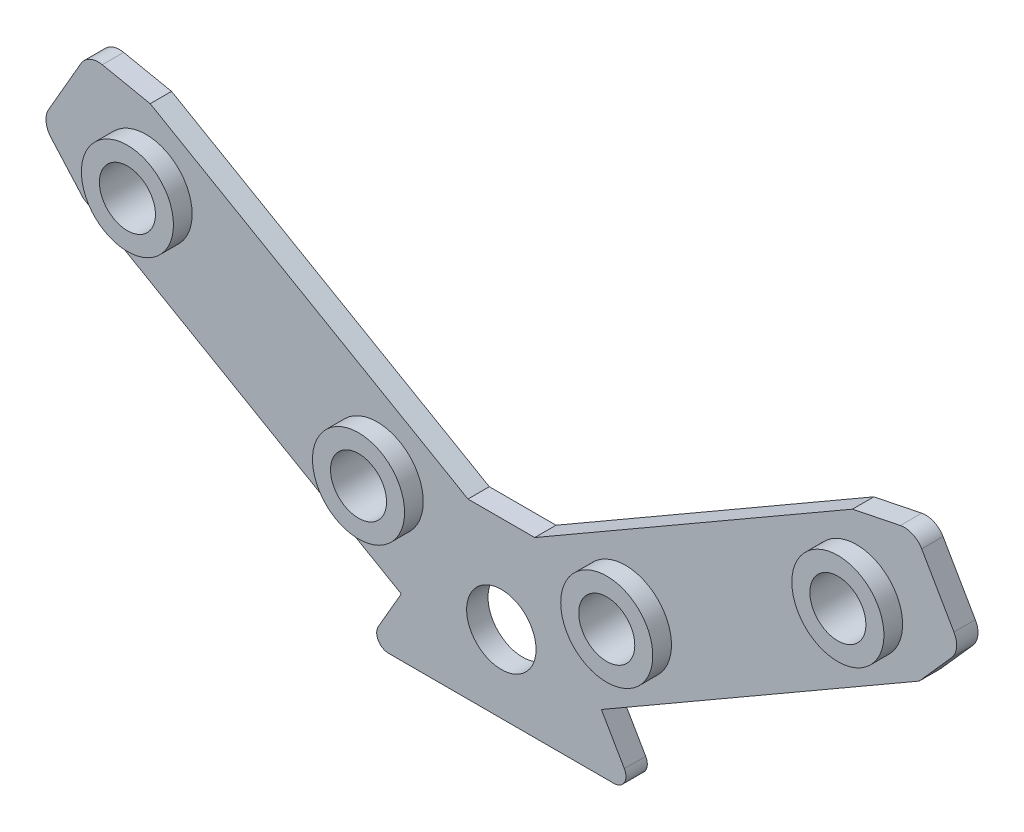
ISO-10303-21;
HEADER;
FILE_DESCRIPTION(('STEP AP214'),'2;1');
FILE_NAME('part.step','',(''),(''),'','','');
FILE_SCHEMA(('AUTOMOTIVE_DESIGN { 1 0 10303 214 1 1 1 1 }'));
ENDSEC;
DATA;
#1=APPLICATION_CONTEXT('core data for automotive mechanical design processes');
#2=APPLICATION_PROTOCOL_DEFINITION('international standard','automotive_design',2000,#1);
#3=PRODUCT_CONTEXT('',#1,'mechanical');
#4=PRODUCT('Part','Part','',(#3));
#5=PRODUCT_RELATED_PRODUCT_CATEGORY('part','',(#4));
#6=PRODUCT_DEFINITION_FORMATION('','',#4);
#7=PRODUCT_DEFINITION_CONTEXT('part definition',#1,'design');
#8=PRODUCT_DEFINITION('design','',#6,#7);
#9=PRODUCT_DEFINITION_SHAPE('','',#8);
#10=(LENGTH_UNIT() NAMED_UNIT(*) SI_UNIT(.MILLI.,.METRE.));
#11=(NAMED_UNIT(*) PLANE_ANGLE_UNIT() SI_UNIT($,.RADIAN.));
#12=(NAMED_UNIT(*) SI_UNIT($,.STERADIAN.) SOLID_ANGLE_UNIT());
#13=UNCERTAINTY_MEASURE_WITH_UNIT(LENGTH_MEASURE(1.E-05),#10,'distance_accuracy_value','');
#14=(GEOMETRIC_REPRESENTATION_CONTEXT(3) GLOBAL_UNCERTAINTY_ASSIGNED_CONTEXT((#13)) GLOBAL_UNIT_ASSIGNED_CONTEXT((#10,
#11,#12)) REPRESENTATION_CONTEXT('',''));
#15=CARTESIAN_POINT('',(0.,0.,0.));
#16=DIRECTION('',(0.,0.,1.));
#17=DIRECTION('',(1.,0.,0.));
#18=AXIS2_PLACEMENT_3D('',#15,#16,#17);
#19=CARTESIAN_POINT('',(-8.44115427318807,-4.87350269189619,1.6));
#20=DIRECTION('',(0.,0.,1.));
#21=DIRECTION('',(1.,0.,0.));
#22=AXIS2_PLACEMENT_3D('',#19,#20,#21);
#23=PLANE('',#22);
#24=CARTESIAN_POINT('',(-9.30111283664478,5.37000000000016,1.6));
#25=DIRECTION('',(0.,0.,1.));
#26=DIRECTION('',(1.,0.,0.));
#27=AXIS2_PLACEMENT_3D('',#24,#25,#26);
#28=CIRCLE('',#27,3.45);
#29=CARTESIAN_POINT('',(-5.85111283664478,5.37000000000016,1.6));
#30=VERTEX_POINT('',#29);
#31=EDGE_CURVE('E454',#30,#30,#28,.T.);
#32=ORIENTED_EDGE('',*,*,#31,.F.);
#33=EDGE_LOOP('',(#32));
#34=FACE_BOUND('',#33,.T.);
#35=CARTESIAN_POINT('',(26.6216209123336,15.3700000000002,1.6));
#36=DIRECTION('',(0.,0.,1.));
#37=DIRECTION('',(-1.,0.,0.));
#38=AXIS2_PLACEMENT_3D('',#35,#36,#37);
#39=CIRCLE('',#38,3.45);
#40=CARTESIAN_POINT('',(23.1716209123336,15.3700000000002,1.6));
#41=VERTEX_POINT('',#40);
#42=EDGE_CURVE('E466',#41,#41,#39,.T.);
#43=ORIENTED_EDGE('',*,*,#42,.F.);
#44=EDGE_LOOP('',(#43));
#45=FACE_BOUND('',#44,.T.);
#46=CARTESIAN_POINT('',(-8.44115427318807,-4.87350269189619,1.6));
#47=DIRECTION('',(0.,0.,1.));
#48=DIRECTION('',(1.,0.,0.));
#49=AXIS2_PLACEMENT_3D('',#46,#47,#48);
#50=CIRCLE('',#49,0.899999999999998);
#51=CARTESIAN_POINT('',(-9.22057713659406,-4.42350269189619,1.6));
#52=VERTEX_POINT('',#51);
#53=CARTESIAN_POINT('',(-8.44115427318807,-5.77350269189619,1.6));
#54=VERTEX_POINT('',#53);
#55=EDGE_CURVE('E243',#52,#54,#50,.T.);
#56=ORIENTED_EDGE('',*,*,#55,.T.);
#57=DIRECTION('',(1.,0.,0.));
#58=VECTOR('',#57,1.);
#59=CARTESIAN_POINT('',(8.44115427318807,-5.77350269189619,1.6));
#60=LINE('',#59,#58);
#61=CARTESIAN_POINT('',(8.44115427318807,-5.77350269189619,1.6));
#62=VERTEX_POINT('',#61);
#63=EDGE_CURVE('E131',#54,#62,#60,.T.);
#64=ORIENTED_EDGE('',*,*,#63,.T.);
#65=CARTESIAN_POINT('',(8.44115427318807,-4.87350269189619,1.6));
#66=DIRECTION('',(0.,0.,1.));
#67=DIRECTION('',(-1.,0.,0.));
#68=AXIS2_PLACEMENT_3D('',#65,#66,#67);
#69=CIRCLE('',#68,0.899999999999998);
#70=CARTESIAN_POINT('',(9.22057713659406,-4.42350269189619,1.6));
#71=VERTEX_POINT('',#70);
#72=EDGE_CURVE('E294',#62,#71,#69,.T.);
#73=ORIENTED_EDGE('',*,*,#72,.T.);
#74=DIRECTION('',(-0.500000000000004,0.866025403784436,0.));
#75=VECTOR('',#74,1.);
#76=CARTESIAN_POINT('',(7.50000000000004,-1.44337567297401,1.6));
#77=LINE('',#76,#75);
#78=CARTESIAN_POINT('',(7.50000000000004,-1.44337567297401,1.6));
#79=VERTEX_POINT('',#78);
#80=EDGE_CURVE('E313',#71,#79,#77,.T.);
#81=ORIENTED_EDGE('',*,*,#80,.T.);
#82=DIRECTION('',(0.866025403784436,0.500000000000004,0.));
#83=VECTOR('',#82,1.);
#84=CARTESIAN_POINT('',(7.50000000000004,-1.44337567297401,1.6));
#85=LINE('',#84,#83);
#86=CARTESIAN_POINT('',(31.315698604072,12.3066243270261,1.6));
#87=VERTEX_POINT('',#86);
#88=EDGE_CURVE('E310',#79,#87,#85,.T.);
#89=ORIENTED_EDGE('',*,*,#88,.T.);
#90=DIRECTION('',(0.663469953249325,0.748202927777844,0.));
#91=VECTOR('',#90,1.);
#92=CARTESIAN_POINT('',(31.315698604072,12.3066243270261,1.6));
#93=LINE('',#92,#91);
#94=CARTESIAN_POINT('',(33.74550979205,15.0467511946995,1.6));
#95=VERTEX_POINT('',#94);
#96=EDGE_CURVE('E312',#87,#95,#93,.T.);
#97=ORIENTED_EDGE('',*,*,#96,.T.);
#98=CARTESIAN_POINT('',(32.6232054003832,16.0419561245735,1.6));
#99=DIRECTION('',(0.,0.,1.));
#100=DIRECTION('',(1.,0.,0.));
#101=AXIS2_PLACEMENT_3D('',#98,#99,#100);
#102=CIRCLE('',#101,1.5);
#103=CARTESIAN_POINT('',(33.9222435060599,16.7919561245735,1.6));
#104=VERTEX_POINT('',#103);
#105=EDGE_CURVE('E315',#95,#104,#102,.T.);
#106=ORIENTED_EDGE('',*,*,#105,.T.);
#107=DIRECTION('',(-0.500000000000004,0.866025403784436,0.));
#108=VECTOR('',#107,1.);
#109=CARTESIAN_POINT('',(31.5033823361441,20.9815465673231,1.6));
#110=LINE('',#109,#108);
#111=CARTESIAN_POINT('',(31.5033823361441,20.9815465673231,1.6));
#112=VERTEX_POINT('',#111);
#113=EDGE_CURVE('E321',#104,#112,#110,.T.);
#114=ORIENTED_EDGE('',*,*,#113,.T.);
#115=CARTESIAN_POINT('',(30.2043442304674,20.2315465673231,1.6));
#116=DIRECTION('',(0.,0.,1.));
#117=DIRECTION('',(-1.,0.,0.));
#118=AXIS2_PLACEMENT_3D('',#115,#116,#117);
#119=CIRCLE('',#118,1.5);
#120=CARTESIAN_POINT('',(29.9036236750584,21.7010931462224,1.6));
#121=VERTEX_POINT('',#120);
#122=EDGE_CURVE('E323',#112,#121,#119,.T.);
#123=ORIENTED_EDGE('',*,*,#122,.T.);
#124=DIRECTION('',(-0.979697719266168,-0.200480370272677,0.));
#125=VECTOR('',#124,1.);
#126=CARTESIAN_POINT('',(26.315698604072,20.9668783648705,1.6));
#127=LINE('',#126,#125);
#128=CARTESIAN_POINT('',(26.315698604072,20.9668783648705,1.6));
#129=VERTEX_POINT('',#128);
#130=EDGE_CURVE('E325',#121,#129,#127,.T.);
#131=ORIENTED_EDGE('',*,*,#130,.T.);
#132=DIRECTION('',(-0.866025403784436,-0.500000000000005,0.));
#133=VECTOR('',#132,1.);
#134=CARTESIAN_POINT('',(2.5,7.21687836487035,1.6));
#135=LINE('',#134,#133);
#136=CARTESIAN_POINT('',(2.5,7.21687836487035,1.6));
#137=VERTEX_POINT('',#136);
#138=EDGE_CURVE('E327',#129,#137,#135,.T.);
#139=ORIENTED_EDGE('',*,*,#138,.T.);
#140=DIRECTION('',(-1.,0.,0.));
#141=VECTOR('',#140,1.);
#142=CARTESIAN_POINT('',(-2.5,7.21687836487035,1.6));
#143=LINE('',#142,#141);
#144=CARTESIAN_POINT('',(-2.5,7.21687836487035,1.6));
#145=VERTEX_POINT('',#144);
#146=EDGE_CURVE('E329',#137,#145,#143,.T.);
#147=ORIENTED_EDGE('',*,*,#146,.T.);
#148=DIRECTION('',(-0.866025403784436,0.500000000000005,0.));
#149=VECTOR('',#148,1.);
#150=CARTESIAN_POINT('',(-2.5,7.21687836487035,1.6));
#151=LINE('',#150,#149);
#152=CARTESIAN_POINT('',(-26.315698604072,20.9668783648705,1.6));
#153=VERTEX_POINT('',#152);
#154=EDGE_CURVE('E331',#145,#153,#151,.T.);
#155=ORIENTED_EDGE('',*,*,#154,.T.);
#156=DIRECTION('',(-0.979697719266168,0.200480370272677,0.));
#157=VECTOR('',#156,1.);
#158=CARTESIAN_POINT('',(-26.315698604072,20.9668783648705,1.6));
#159=LINE('',#158,#157);
#160=CARTESIAN_POINT('',(-29.9036236750584,21.7010931462224,1.6));
#161=VERTEX_POINT('',#160);
#162=EDGE_CURVE('E333',#153,#161,#159,.T.);
#163=ORIENTED_EDGE('',*,*,#162,.T.);
#164=CARTESIAN_POINT('',(-30.2043442304674,20.2315465673231,1.6));
#165=DIRECTION('',(0.,0.,1.));
#166=DIRECTION('',(-1.,0.,0.));
#167=AXIS2_PLACEMENT_3D('',#164,#165,#166);
#168=CIRCLE('',#167,1.5);
#169=CARTESIAN_POINT('',(-31.5033823361441,20.9815465673231,1.6));
#170=VERTEX_POINT('',#169);
#171=EDGE_CURVE('E335',#161,#170,#168,.T.);
#172=ORIENTED_EDGE('',*,*,#171,.T.);
#173=DIRECTION('',(-0.500000000000004,-0.866025403784436,0.));
#174=VECTOR('',#173,1.);
#175=CARTESIAN_POINT('',(-31.5033823361441,20.9815465673231,1.6));
#176=LINE('',#175,#174);
#177=CARTESIAN_POINT('',(-33.9222435060599,16.7919561245735,1.6));
#178=VERTEX_POINT('',#177);
#179=EDGE_CURVE('E337',#170,#178,#176,.T.);
#180=ORIENTED_EDGE('',*,*,#179,.T.);
#181=CARTESIAN_POINT('',(-32.6232054003832,16.0419561245735,1.6));
#182=DIRECTION('',(0.,0.,1.));
#183=DIRECTION('',(-1.,0.,0.));
#184=AXIS2_PLACEMENT_3D('',#181,#182,#183);
#185=CIRCLE('',#184,1.5);
#186=CARTESIAN_POINT('',(-33.74550979205,15.0467511946995,1.6));
#187=VERTEX_POINT('',#186);
#188=EDGE_CURVE('E186',#178,#187,#185,.T.);
#189=ORIENTED_EDGE('',*,*,#188,.T.);
#190=DIRECTION('',(0.663469953249326,-0.748202927777844,0.));
#191=VECTOR('',#190,1.);
#192=CARTESIAN_POINT('',(-31.315698604072,12.3066243270261,1.6));
#193=LINE('',#192,#191);
#194=CARTESIAN_POINT('',(-31.315698604072,12.3066243270261,1.6));
#195=VERTEX_POINT('',#194);
#196=EDGE_CURVE('E180',#187,#195,#193,.T.);
#197=ORIENTED_EDGE('',*,*,#196,.T.);
#198=DIRECTION('',(0.866025403784436,-0.500000000000004,0.));
#199=VECTOR('',#198,1.);
#200=CARTESIAN_POINT('',(-7.50000000000004,-1.44337567297401,1.6));
#201=LINE('',#200,#199);
#202=CARTESIAN_POINT('',(-7.50000000000004,-1.44337567297401,1.6));
#203=VERTEX_POINT('',#202);
#204=EDGE_CURVE('E184',#195,#203,#201,.T.);
#205=ORIENTED_EDGE('',*,*,#204,.T.);
#206=DIRECTION('',(-0.500000000000004,-0.866025403784436,0.));
#207=VECTOR('',#206,1.);
#208=CARTESIAN_POINT('',(-7.50000000000004,-1.44337567297401,1.6));
#209=LINE('',#208,#207);
#210=EDGE_CURVE('E52',#203,#52,#209,.T.);
#211=ORIENTED_EDGE('',*,*,#210,.T.);
#212=EDGE_LOOP('',(#56,#64,#73,#81,#89,#97,#106,#114,#123,#131,#139,#147,#155,#163,#172,#180,
#189,#197,#205,#211));
#213=FACE_BOUND('',#212,.T.);
#214=CARTESIAN_POINT('',(0.,0.,1.6));
#215=DIRECTION('',(0.,0.,1.));
#216=DIRECTION('',(1.,0.,0.));
#217=AXIS2_PLACEMENT_3D('',#214,#215,#216);
#218=CIRCLE('',#217,2.6);
#219=CARTESIAN_POINT('',(2.6,0.,1.6));
#220=VERTEX_POINT('',#219);
#221=EDGE_CURVE('E208',#220,#220,#218,.T.);
#222=ORIENTED_EDGE('',*,*,#221,.F.);
#223=EDGE_LOOP('',(#222));
#224=FACE_BOUND('',#223,.T.);
#225=CARTESIAN_POINT('',(9.30111283664478,5.37000000000016,1.6));
#226=DIRECTION('',(0.,0.,1.));
#227=DIRECTION('',(-1.,0.,0.));
#228=AXIS2_PLACEMENT_3D('',#225,#226,#227);
#229=CIRCLE('',#228,3.45);
#230=CARTESIAN_POINT('',(5.85111283664478,5.37000000000016,1.6));
#231=VERTEX_POINT('',#230);
#232=EDGE_CURVE('E460',#231,#231,#229,.T.);
#233=ORIENTED_EDGE('',*,*,#232,.F.);
#234=EDGE_LOOP('',(#233));
#235=FACE_BOUND('',#234,.T.);
#236=CARTESIAN_POINT('',(-26.6216209123336,15.3700000000002,1.6));
#237=DIRECTION('',(0.,0.,1.));
#238=DIRECTION('',(1.,0.,0.));
#239=AXIS2_PLACEMENT_3D('',#236,#237,#238);
#240=CIRCLE('',#239,3.45);
#241=CARTESIAN_POINT('',(-23.1716209123336,15.3700000000002,1.6));
#242=VERTEX_POINT('',#241);
#243=EDGE_CURVE('E450',#242,#242,#240,.T.);
#244=ORIENTED_EDGE('',*,*,#243,.F.);
#245=EDGE_LOOP('',(#244));
#246=FACE_BOUND('',#245,.T.);
#247=ADVANCED_FACE('F35',(#34,#45,#213,#224,#235,#246),#23,.T.);
#248=CARTESIAN_POINT('',(-8.44115427318807,-4.87350269189619,0.));
#249=DIRECTION('',(0.,0.,1.));
#250=DIRECTION('',(1.,0.,0.));
#251=AXIS2_PLACEMENT_3D('',#248,#249,#250);
#252=PLANE('',#251);
#253=CARTESIAN_POINT('',(26.6216209123336,15.3700000000002,0.));
#254=DIRECTION('',(0.,0.,1.));
#255=DIRECTION('',(1.,0.,0.));
#256=AXIS2_PLACEMENT_3D('',#253,#254,#255);
#257=CIRCLE('',#256,2.1);
#258=CARTESIAN_POINT('',(28.7216209123336,15.3700000000002,0.));
#259=VERTEX_POINT('',#258);
#260=EDGE_CURVE('E425',#259,#259,#257,.T.);
#261=ORIENTED_EDGE('',*,*,#260,.T.);
#262=EDGE_LOOP('',(#261));
#263=FACE_BOUND('',#262,.T.);
#264=CARTESIAN_POINT('',(9.30111283664478,5.37000000000016,0.));
#265=DIRECTION('',(0.,0.,1.));
#266=DIRECTION('',(1.,0.,0.));
#267=AXIS2_PLACEMENT_3D('',#264,#265,#266);
#268=CIRCLE('',#267,2.1);
#269=CARTESIAN_POINT('',(11.4011128366448,5.37000000000016,0.));
#270=VERTEX_POINT('',#269);
#271=EDGE_CURVE('E435',#270,#270,#268,.T.);
#272=ORIENTED_EDGE('',*,*,#271,.T.);
#273=EDGE_LOOP('',(#272));
#274=FACE_BOUND('',#273,.T.);
#275=CARTESIAN_POINT('',(-9.30111283664478,5.37000000000016,0.));
#276=DIRECTION('',(0.,0.,1.));
#277=DIRECTION('',(1.,0.,0.));
#278=AXIS2_PLACEMENT_3D('',#275,#276,#277);
#279=CIRCLE('',#278,2.1);
#280=CARTESIAN_POINT('',(-7.20111283664478,5.37000000000016,0.));
#281=VERTEX_POINT('',#280);
#282=EDGE_CURVE('E441',#281,#281,#279,.T.);
#283=ORIENTED_EDGE('',*,*,#282,.T.);
#284=EDGE_LOOP('',(#283));
#285=FACE_BOUND('',#284,.T.);
#286=CARTESIAN_POINT('',(-26.6216209123336,15.3700000000002,0.));
#287=DIRECTION('',(0.,0.,1.));
#288=DIRECTION('',(1.,0.,0.));
#289=AXIS2_PLACEMENT_3D('',#286,#287,#288);
#290=CIRCLE('',#289,2.1);
#291=CARTESIAN_POINT('',(-24.5216209123336,15.3700000000002,0.));
#292=VERTEX_POINT('',#291);
#293=EDGE_CURVE('E447',#292,#292,#290,.T.);
#294=ORIENTED_EDGE('',*,*,#293,.T.);
#295=EDGE_LOOP('',(#294));
#296=FACE_BOUND('',#295,.T.);
#297=CARTESIAN_POINT('',(-8.44115427318807,-4.87350269189619,0.));
#298=DIRECTION('',(0.,0.,1.));
#299=DIRECTION('',(1.,0.,0.));
#300=AXIS2_PLACEMENT_3D('',#297,#298,#299);
#301=CIRCLE('',#300,0.899999999999998);
#302=CARTESIAN_POINT('',(-9.22057713659406,-4.42350269189619,0.));
#303=VERTEX_POINT('',#302);
#304=CARTESIAN_POINT('',(-8.44115427318807,-5.77350269189619,0.));
#305=VERTEX_POINT('',#304);
#306=EDGE_CURVE('E204',#303,#305,#301,.T.);
#307=ORIENTED_EDGE('',*,*,#306,.F.);
#308=DIRECTION('',(-0.500000000000004,-0.866025403784436,0.));
#309=VECTOR('',#308,1.);
#310=CARTESIAN_POINT('',(-7.50000000000004,-1.44337567297401,0.));
#311=LINE('',#310,#309);
#312=CARTESIAN_POINT('',(-7.50000000000004,-1.44337567297401,0.));
#313=VERTEX_POINT('',#312);
#314=EDGE_CURVE('E123',#313,#303,#311,.T.);
#315=ORIENTED_EDGE('',*,*,#314,.F.);
#316=DIRECTION('',(0.866025403784436,-0.500000000000004,0.));
#317=VECTOR('',#316,1.);
#318=CARTESIAN_POINT('',(-7.50000000000004,-1.44337567297401,0.));
#319=LINE('',#318,#317);
#320=CARTESIAN_POINT('',(-31.315698604072,12.3066243270261,0.));
#321=VERTEX_POINT('',#320);
#322=EDGE_CURVE('E117',#321,#313,#319,.T.);
#323=ORIENTED_EDGE('',*,*,#322,.F.);
#324=DIRECTION('',(0.663469953249326,-0.748202927777844,0.));
#325=VECTOR('',#324,1.);
#326=CARTESIAN_POINT('',(-31.315698604072,12.3066243270261,0.));
#327=LINE('',#326,#325);
#328=CARTESIAN_POINT('',(-33.74550979205,15.0467511946995,0.));
#329=VERTEX_POINT('',#328);
#330=EDGE_CURVE('E194',#329,#321,#327,.T.);
#331=ORIENTED_EDGE('',*,*,#330,.F.);
#332=CARTESIAN_POINT('',(-32.6232054003832,16.0419561245735,0.));
#333=DIRECTION('',(0.,0.,1.));
#334=DIRECTION('',(-1.,0.,0.));
#335=AXIS2_PLACEMENT_3D('',#332,#333,#334);
#336=CIRCLE('',#335,1.5);
#337=CARTESIAN_POINT('',(-33.9222435060599,16.7919561245735,0.));
#338=VERTEX_POINT('',#337);
#339=EDGE_CURVE('E238',#338,#329,#336,.T.);
#340=ORIENTED_EDGE('',*,*,#339,.F.);
#341=DIRECTION('',(-0.500000000000004,-0.866025403784436,0.));
#342=VECTOR('',#341,1.);
#343=CARTESIAN_POINT('',(-31.5033823361441,20.9815465673231,0.));
#344=LINE('',#343,#342);
#345=CARTESIAN_POINT('',(-31.5033823361441,20.9815465673231,0.));
#346=VERTEX_POINT('',#345);
#347=EDGE_CURVE('E236',#346,#338,#344,.T.);
#348=ORIENTED_EDGE('',*,*,#347,.F.);
#349=CARTESIAN_POINT('',(-30.2043442304674,20.2315465673231,0.));
#350=DIRECTION('',(0.,0.,1.));
#351=DIRECTION('',(-1.,0.,0.));
#352=AXIS2_PLACEMENT_3D('',#349,#350,#351);
#353=CIRCLE('',#352,1.5);
#354=CARTESIAN_POINT('',(-29.9036236750584,21.7010931462224,0.));
#355=VERTEX_POINT('',#354);
#356=EDGE_CURVE('E234',#355,#346,#353,.T.);
#357=ORIENTED_EDGE('',*,*,#356,.F.);
#358=DIRECTION('',(-0.979697719266168,0.200480370272677,0.));
#359=VECTOR('',#358,1.);
#360=CARTESIAN_POINT('',(-26.315698604072,20.9668783648705,0.));
#361=LINE('',#360,#359);
#362=CARTESIAN_POINT('',(-26.315698604072,20.9668783648705,0.));
#363=VERTEX_POINT('',#362);
#364=EDGE_CURVE('E232',#363,#355,#361,.T.);
#365=ORIENTED_EDGE('',*,*,#364,.F.);
#366=DIRECTION('',(-0.866025403784436,0.500000000000005,0.));
#367=VECTOR('',#366,1.);
#368=CARTESIAN_POINT('',(-2.5,7.21687836487035,0.));
#369=LINE('',#368,#367);
#370=CARTESIAN_POINT('',(-2.5,7.21687836487035,0.));
#371=VERTEX_POINT('',#370);
#372=EDGE_CURVE('E230',#371,#363,#369,.T.);
#373=ORIENTED_EDGE('',*,*,#372,.F.);
#374=DIRECTION('',(-1.,0.,0.));
#375=VECTOR('',#374,1.);
#376=CARTESIAN_POINT('',(-2.5,7.21687836487035,0.));
#377=LINE('',#376,#375);
#378=CARTESIAN_POINT('',(2.5,7.21687836487035,0.));
#379=VERTEX_POINT('',#378);
#380=EDGE_CURVE('E228',#379,#371,#377,.T.);
#381=ORIENTED_EDGE('',*,*,#380,.F.);
#382=DIRECTION('',(-0.866025403784436,-0.500000000000005,0.));
#383=VECTOR('',#382,1.);
#384=CARTESIAN_POINT('',(2.5,7.21687836487035,0.));
#385=LINE('',#384,#383);
#386=CARTESIAN_POINT('',(26.315698604072,20.9668783648705,0.));
#387=VERTEX_POINT('',#386);
#388=EDGE_CURVE('E226',#387,#379,#385,.T.);
#389=ORIENTED_EDGE('',*,*,#388,.F.);
#390=DIRECTION('',(-0.979697719266168,-0.200480370272677,0.));
#391=VECTOR('',#390,1.);
#392=CARTESIAN_POINT('',(26.315698604072,20.9668783648705,0.));
#393=LINE('',#392,#391);
#394=CARTESIAN_POINT('',(29.9036236750584,21.7010931462224,0.));
#395=VERTEX_POINT('',#394);
#396=EDGE_CURVE('E224',#395,#387,#393,.T.);
#397=ORIENTED_EDGE('',*,*,#396,.F.);
#398=CARTESIAN_POINT('',(30.2043442304674,20.2315465673231,0.));
#399=DIRECTION('',(0.,0.,1.));
#400=DIRECTION('',(-1.,0.,0.));
#401=AXIS2_PLACEMENT_3D('',#398,#399,#400);
#402=CIRCLE('',#401,1.5);
#403=CARTESIAN_POINT('',(31.5033823361441,20.9815465673231,0.));
#404=VERTEX_POINT('',#403);
#405=EDGE_CURVE('E222',#404,#395,#402,.T.);
#406=ORIENTED_EDGE('',*,*,#405,.F.);
#407=DIRECTION('',(-0.500000000000004,0.866025403784436,0.));
#408=VECTOR('',#407,1.);
#409=CARTESIAN_POINT('',(31.5033823361441,20.9815465673231,0.));
#410=LINE('',#409,#408);
#411=CARTESIAN_POINT('',(33.9222435060599,16.7919561245735,0.));
#412=VERTEX_POINT('',#411);
#413=EDGE_CURVE('E220',#412,#404,#410,.T.);
#414=ORIENTED_EDGE('',*,*,#413,.F.);
#415=CARTESIAN_POINT('',(32.6232054003832,16.0419561245735,0.));
#416=DIRECTION('',(0.,0.,1.));
#417=DIRECTION('',(1.,0.,0.));
#418=AXIS2_PLACEMENT_3D('',#415,#416,#417);
#419=CIRCLE('',#418,1.5);
#420=CARTESIAN_POINT('',(33.74550979205,15.0467511946995,0.));
#421=VERTEX_POINT('',#420);
#422=EDGE_CURVE('E218',#421,#412,#419,.T.);
#423=ORIENTED_EDGE('',*,*,#422,.F.);
#424=DIRECTION('',(0.663469953249325,0.748202927777844,0.));
#425=VECTOR('',#424,1.);
#426=CARTESIAN_POINT('',(31.315698604072,12.3066243270261,0.));
#427=LINE('',#426,#425);
#428=CARTESIAN_POINT('',(31.315698604072,12.3066243270261,0.));
#429=VERTEX_POINT('',#428);
#430=EDGE_CURVE('E216',#429,#421,#427,.T.);
#431=ORIENTED_EDGE('',*,*,#430,.F.);
#432=DIRECTION('',(0.866025403784436,0.500000000000004,0.));
#433=VECTOR('',#432,1.);
#434=CARTESIAN_POINT('',(7.50000000000004,-1.44337567297401,0.));
#435=LINE('',#434,#433);
#436=CARTESIAN_POINT('',(7.50000000000004,-1.44337567297401,0.));
#437=VERTEX_POINT('',#436);
#438=EDGE_CURVE('E214',#437,#429,#435,.T.);
#439=ORIENTED_EDGE('',*,*,#438,.F.);
#440=DIRECTION('',(-0.500000000000004,0.866025403784436,0.));
#441=VECTOR('',#440,1.);
#442=CARTESIAN_POINT('',(7.50000000000004,-1.44337567297401,0.));
#443=LINE('',#442,#441);
#444=CARTESIAN_POINT('',(9.22057713659406,-4.42350269189619,0.));
#445=VERTEX_POINT('',#444);
#446=EDGE_CURVE('E212',#445,#437,#443,.T.);
#447=ORIENTED_EDGE('',*,*,#446,.F.);
#448=CARTESIAN_POINT('',(8.44115427318807,-4.87350269189619,0.));
#449=DIRECTION('',(0.,0.,1.));
#450=DIRECTION('',(-1.,0.,0.));
#451=AXIS2_PLACEMENT_3D('',#448,#449,#450);
#452=CIRCLE('',#451,0.899999999999998);
#453=CARTESIAN_POINT('',(8.44115427318807,-5.77350269189619,0.));
#454=VERTEX_POINT('',#453);
#455=EDGE_CURVE('E210',#454,#445,#452,.T.);
#456=ORIENTED_EDGE('',*,*,#455,.F.);
#457=DIRECTION('',(1.,0.,0.));
#458=VECTOR('',#457,1.);
#459=CARTESIAN_POINT('',(8.44115427318807,-5.77350269189619,0.));
#460=LINE('',#459,#458);
#461=EDGE_CURVE('E207',#305,#454,#460,.T.);
#462=ORIENTED_EDGE('',*,*,#461,.F.);
#463=EDGE_LOOP('',(#307,#315,#323,#331,#340,#348,#357,#365,#373,#381,#389,#397,#406,#414,#423,
#431,#439,#447,#456,#462));
#464=FACE_BOUND('',#463,.T.);
#465=CARTESIAN_POINT('',(0.,0.,0.));
#466=DIRECTION('',(0.,0.,1.));
#467=DIRECTION('',(1.,0.,0.));
#468=AXIS2_PLACEMENT_3D('',#465,#466,#467);
#469=CIRCLE('',#468,2.6);
#470=CARTESIAN_POINT('',(2.6,0.,0.));
#471=VERTEX_POINT('',#470);
#472=EDGE_CURVE('E472',#471,#471,#469,.T.);
#473=ORIENTED_EDGE('',*,*,#472,.T.);
#474=EDGE_LOOP('',(#473));
#475=FACE_BOUND('',#474,.T.);
#476=ADVANCED_FACE('F298',(#263,#274,#285,#296,#464,#475),#252,.F.);
#477=CARTESIAN_POINT('',(-8.44115427318807,-4.87350269189619,1.6));
#478=DIRECTION('',(0.,0.,-1.));
#479=DIRECTION('',(-1.,0.,0.));
#480=AXIS2_PLACEMENT_3D('',#477,#478,#479);
#481=CYLINDRICAL_SURFACE('',#480,0.899999999999998);
#482=ORIENTED_EDGE('',*,*,#306,.T.);
#483=DIRECTION('',(0.,0.,-1.));
#484=VECTOR('',#483,1.);
#485=CARTESIAN_POINT('',(-8.44115427318807,-5.77350269189619,1.6));
#486=LINE('',#485,#484);
#487=EDGE_CURVE('E11',#54,#305,#486,.T.);
#488=ORIENTED_EDGE('',*,*,#487,.F.);
#489=ORIENTED_EDGE('',*,*,#55,.F.);
#490=DIRECTION('',(0.,0.,-1.));
#491=VECTOR('',#490,1.);
#492=CARTESIAN_POINT('',(-9.22057713659406,-4.42350269189619,1.6));
#493=LINE('',#492,#491);
#494=EDGE_CURVE('E200',#52,#303,#493,.T.);
#495=ORIENTED_EDGE('',*,*,#494,.T.);
#496=EDGE_LOOP('',(#482,#488,#489,#495));
#497=FACE_BOUND('',#496,.T.);
#498=ADVANCED_FACE('F37',(#497),#481,.T.);
#499=CARTESIAN_POINT('',(8.44115427318807,-5.77350269189619,1.6));
#500=DIRECTION('',(0.,1.,0.));
#501=DIRECTION('',(0.,0.,1.));
#502=AXIS2_PLACEMENT_3D('',#499,#500,#501);
#503=PLANE('',#502);
#504=ORIENTED_EDGE('',*,*,#461,.T.);
#505=DIRECTION('',(0.,0.,-1.));
#506=VECTOR('',#505,1.);
#507=CARTESIAN_POINT('',(8.44115427318807,-5.77350269189619,1.6));
#508=LINE('',#507,#506);
#509=EDGE_CURVE('E44',#62,#454,#508,.T.);
#510=ORIENTED_EDGE('',*,*,#509,.F.);
#511=ORIENTED_EDGE('',*,*,#63,.F.);
#512=ORIENTED_EDGE('',*,*,#487,.T.);
#513=EDGE_LOOP('',(#504,#510,#511,#512));
#514=FACE_BOUND('',#513,.T.);
#515=ADVANCED_FACE('F756',(#514),#503,.F.);
#516=CARTESIAN_POINT('',(8.44115427318807,-4.87350269189619,1.6));
#517=DIRECTION('',(0.,0.,-1.));
#518=DIRECTION('',(-1.,0.,0.));
#519=AXIS2_PLACEMENT_3D('',#516,#517,#518);
#520=CYLINDRICAL_SURFACE('',#519,0.899999999999998);
#521=ORIENTED_EDGE('',*,*,#455,.T.);
#522=DIRECTION('',(0.,0.,-1.));
#523=VECTOR('',#522,1.);
#524=CARTESIAN_POINT('',(9.22057713659406,-4.42350269189619,1.6));
#525=LINE('',#524,#523);
#526=EDGE_CURVE('E286',#71,#445,#525,.T.);
#527=ORIENTED_EDGE('',*,*,#526,.F.);
#528=ORIENTED_EDGE('',*,*,#72,.F.);
#529=ORIENTED_EDGE('',*,*,#509,.T.);
#530=EDGE_LOOP('',(#521,#527,#528,#529));
#531=FACE_BOUND('',#530,.T.);
#532=ADVANCED_FACE('F292',(#531),#520,.T.);
#533=CARTESIAN_POINT('',(7.50000000000004,-1.44337567297401,1.6));
#534=DIRECTION('',(-0.866025403784436,-0.500000000000004,0.));
#535=DIRECTION('',(0.500000000000004,-0.866025403784436,0.));
#536=AXIS2_PLACEMENT_3D('',#533,#534,#535);
#537=PLANE('',#536);
#538=ORIENTED_EDGE('',*,*,#446,.T.);
#539=DIRECTION('',(0.,0.,-1.));
#540=VECTOR('',#539,1.);
#541=CARTESIAN_POINT('',(7.50000000000004,-1.44337567297401,1.6));
#542=LINE('',#541,#540);
#543=EDGE_CURVE('E283',#79,#437,#542,.T.);
#544=ORIENTED_EDGE('',*,*,#543,.F.);
#545=ORIENTED_EDGE('',*,*,#80,.F.);
#546=ORIENTED_EDGE('',*,*,#526,.T.);
#547=EDGE_LOOP('',(#538,#544,#545,#546));
#548=FACE_BOUND('',#547,.T.);
#549=ADVANCED_FACE('F304',(#548),#537,.F.);
#550=CARTESIAN_POINT('',(7.50000000000004,-1.44337567297401,1.6));
#551=DIRECTION('',(-0.500000000000004,0.866025403784436,0.));
#552=DIRECTION('',(-0.866025403784436,-0.500000000000004,0.));
#553=AXIS2_PLACEMENT_3D('',#550,#551,#552);
#554=PLANE('',#553);
#555=ORIENTED_EDGE('',*,*,#438,.T.);
#556=DIRECTION('',(0.,0.,-1.));
#557=VECTOR('',#556,1.);
#558=CARTESIAN_POINT('',(31.315698604072,12.3066243270261,1.6));
#559=LINE('',#558,#557);
#560=EDGE_CURVE('E280',#87,#429,#559,.T.);
#561=ORIENTED_EDGE('',*,*,#560,.F.);
#562=ORIENTED_EDGE('',*,*,#88,.F.);
#563=ORIENTED_EDGE('',*,*,#543,.T.);
#564=EDGE_LOOP('',(#555,#561,#562,#563));
#565=FACE_BOUND('',#564,.T.);
#566=ADVANCED_FACE('F308',(#565),#554,.F.);
#567=CARTESIAN_POINT('',(31.315698604072,12.3066243270261,1.6));
#568=DIRECTION('',(-0.748202927777844,0.663469953249325,0.));
#569=DIRECTION('',(-0.663469953249325,-0.748202927777844,0.));
#570=AXIS2_PLACEMENT_3D('',#567,#568,#569);
#571=PLANE('',#570);
#572=ORIENTED_EDGE('',*,*,#430,.T.);
#573=DIRECTION('',(0.,0.,-1.));
#574=VECTOR('',#573,1.);
#575=CARTESIAN_POINT('',(33.74550979205,15.0467511946995,1.6));
#576=LINE('',#575,#574);
#577=EDGE_CURVE('E277',#95,#421,#576,.T.);
#578=ORIENTED_EDGE('',*,*,#577,.F.);
#579=ORIENTED_EDGE('',*,*,#96,.F.);
#580=ORIENTED_EDGE('',*,*,#560,.T.);
#581=EDGE_LOOP('',(#572,#578,#579,#580));
#582=FACE_BOUND('',#581,.T.);
#583=ADVANCED_FACE('F721',(#582),#571,.F.);
#584=CARTESIAN_POINT('',(32.6232054003832,16.0419561245735,1.6));
#585=DIRECTION('',(0.,0.,-1.));
#586=DIRECTION('',(-1.,0.,0.));
#587=AXIS2_PLACEMENT_3D('',#584,#585,#586);
#588=CYLINDRICAL_SURFACE('',#587,1.5);
#589=ORIENTED_EDGE('',*,*,#422,.T.);
#590=DIRECTION('',(0.,0.,-1.));
#591=VECTOR('',#590,1.);
#592=CARTESIAN_POINT('',(33.9222435060599,16.7919561245735,1.6));
#593=LINE('',#592,#591);
#594=EDGE_CURVE('E274',#104,#412,#593,.T.);
#595=ORIENTED_EDGE('',*,*,#594,.F.);
#596=ORIENTED_EDGE('',*,*,#105,.F.);
#597=ORIENTED_EDGE('',*,*,#577,.T.);
#598=EDGE_LOOP('',(#589,#595,#596,#597));
#599=FACE_BOUND('',#598,.T.);
#600=ADVANCED_FACE('F711',(#599),#588,.T.);
#601=CARTESIAN_POINT('',(31.5033823361441,20.9815465673231,1.6));
#602=DIRECTION('',(-0.866025403784436,-0.500000000000004,0.));
#603=DIRECTION('',(0.500000000000005,-0.866025403784436,0.));
#604=AXIS2_PLACEMENT_3D('',#601,#602,#603);
#605=PLANE('',#604);
#606=ORIENTED_EDGE('',*,*,#413,.T.);
#607=DIRECTION('',(0.,0.,-1.));
#608=VECTOR('',#607,1.);
#609=CARTESIAN_POINT('',(31.5033823361441,20.9815465673231,1.6));
#610=LINE('',#609,#608);
#611=EDGE_CURVE('E271',#112,#404,#610,.T.);
#612=ORIENTED_EDGE('',*,*,#611,.F.);
#613=ORIENTED_EDGE('',*,*,#113,.F.);
#614=ORIENTED_EDGE('',*,*,#594,.T.);
#615=EDGE_LOOP('',(#606,#612,#613,#614));
#616=FACE_BOUND('',#615,.T.);
#617=ADVANCED_FACE('F701',(#616),#605,.F.);
#618=CARTESIAN_POINT('',(30.2043442304674,20.2315465673231,1.6));
#619=DIRECTION('',(0.,0.,-1.));
#620=DIRECTION('',(-1.,0.,0.));
#621=AXIS2_PLACEMENT_3D('',#618,#619,#620);
#622=CYLINDRICAL_SURFACE('',#621,1.5);
#623=ORIENTED_EDGE('',*,*,#405,.T.);
#624=DIRECTION('',(0.,0.,-1.));
#625=VECTOR('',#624,1.);
#626=CARTESIAN_POINT('',(29.9036236750584,21.7010931462224,1.6));
#627=LINE('',#626,#625);
#628=EDGE_CURVE('E268',#121,#395,#627,.T.);
#629=ORIENTED_EDGE('',*,*,#628,.F.);
#630=ORIENTED_EDGE('',*,*,#122,.F.);
#631=ORIENTED_EDGE('',*,*,#611,.T.);
#632=EDGE_LOOP('',(#623,#629,#630,#631));
#633=FACE_BOUND('',#632,.T.);
#634=ADVANCED_FACE('F691',(#633),#622,.T.);
#635=CARTESIAN_POINT('',(26.315698604072,20.9668783648705,1.6));
#636=DIRECTION('',(0.200480370272677,-0.979697719266168,0.));
#637=DIRECTION('',(0.979697719266168,0.200480370272677,0.));
#638=AXIS2_PLACEMENT_3D('',#635,#636,#637);
#639=PLANE('',#638);
#640=ORIENTED_EDGE('',*,*,#396,.T.);
#641=DIRECTION('',(0.,0.,-1.));
#642=VECTOR('',#641,1.);
#643=CARTESIAN_POINT('',(26.315698604072,20.9668783648705,1.6));
#644=LINE('',#643,#642);
#645=EDGE_CURVE('E265',#129,#387,#644,.T.);
#646=ORIENTED_EDGE('',*,*,#645,.F.);
#647=ORIENTED_EDGE('',*,*,#130,.F.);
#648=ORIENTED_EDGE('',*,*,#628,.T.);
#649=EDGE_LOOP('',(#640,#646,#647,#648));
#650=FACE_BOUND('',#649,.T.);
#651=ADVANCED_FACE('F681',(#650),#639,.F.);
#652=CARTESIAN_POINT('',(2.5,7.21687836487035,1.6));
#653=DIRECTION('',(0.500000000000005,-0.866025403784436,0.));
#654=DIRECTION('',(0.866025403784436,0.500000000000005,0.));
#655=AXIS2_PLACEMENT_3D('',#652,#653,#654);
#656=PLANE('',#655);
#657=ORIENTED_EDGE('',*,*,#388,.T.);
#658=DIRECTION('',(0.,0.,-1.));
#659=VECTOR('',#658,1.);
#660=CARTESIAN_POINT('',(2.5,7.21687836487035,1.6));
#661=LINE('',#660,#659);
#662=EDGE_CURVE('E262',#137,#379,#661,.T.);
#663=ORIENTED_EDGE('',*,*,#662,.F.);
#664=ORIENTED_EDGE('',*,*,#138,.F.);
#665=ORIENTED_EDGE('',*,*,#645,.T.);
#666=EDGE_LOOP('',(#657,#663,#664,#665));
#667=FACE_BOUND('',#666,.T.);
#668=ADVANCED_FACE('F671',(#667),#656,.F.);
#669=CARTESIAN_POINT('',(-2.5,7.21687836487035,1.6));
#670=DIRECTION('',(0.,-1.,0.));
#671=DIRECTION('',(0.,0.,-1.));
#672=AXIS2_PLACEMENT_3D('',#669,#670,#671);
#673=PLANE('',#672);
#674=ORIENTED_EDGE('',*,*,#380,.T.);
#675=DIRECTION('',(0.,0.,-1.));
#676=VECTOR('',#675,1.);
#677=CARTESIAN_POINT('',(-2.5,7.21687836487035,1.6));
#678=LINE('',#677,#676);
#679=EDGE_CURVE('E259',#145,#371,#678,.T.);
#680=ORIENTED_EDGE('',*,*,#679,.F.);
#681=ORIENTED_EDGE('',*,*,#146,.F.);
#682=ORIENTED_EDGE('',*,*,#662,.T.);
#683=EDGE_LOOP('',(#674,#680,#681,#682));
#684=FACE_BOUND('',#683,.T.);
#685=ADVANCED_FACE('F661',(#684),#673,.F.);
#686=CARTESIAN_POINT('',(-2.5,7.21687836487035,1.6));
#687=DIRECTION('',(-0.500000000000005,-0.866025403784436,0.));
#688=DIRECTION('',(0.866025403784436,-0.500000000000005,0.));
#689=AXIS2_PLACEMENT_3D('',#686,#687,#688);
#690=PLANE('',#689);
#691=ORIENTED_EDGE('',*,*,#372,.T.);
#692=DIRECTION('',(0.,0.,-1.));
#693=VECTOR('',#692,1.);
#694=CARTESIAN_POINT('',(-26.315698604072,20.9668783648705,1.6));
#695=LINE('',#694,#693);
#696=EDGE_CURVE('E256',#153,#363,#695,.T.);
#697=ORIENTED_EDGE('',*,*,#696,.F.);
#698=ORIENTED_EDGE('',*,*,#154,.F.);
#699=ORIENTED_EDGE('',*,*,#679,.T.);
#700=EDGE_LOOP('',(#691,#697,#698,#699));
#701=FACE_BOUND('',#700,.T.);
#702=ADVANCED_FACE('F651',(#701),#690,.F.);
#703=CARTESIAN_POINT('',(-26.315698604072,20.9668783648705,1.6));
#704=DIRECTION('',(-0.200480370272677,-0.979697719266168,0.));
#705=DIRECTION('',(0.979697719266168,-0.200480370272677,0.));
#706=AXIS2_PLACEMENT_3D('',#703,#704,#705);
#707=PLANE('',#706);
#708=ORIENTED_EDGE('',*,*,#364,.T.);
#709=DIRECTION('',(0.,0.,-1.));
#710=VECTOR('',#709,1.);
#711=CARTESIAN_POINT('',(-29.9036236750584,21.7010931462224,1.6));
#712=LINE('',#711,#710);
#713=EDGE_CURVE('E253',#161,#355,#712,.T.);
#714=ORIENTED_EDGE('',*,*,#713,.F.);
#715=ORIENTED_EDGE('',*,*,#162,.F.);
#716=ORIENTED_EDGE('',*,*,#696,.T.);
#717=EDGE_LOOP('',(#708,#714,#715,#716));
#718=FACE_BOUND('',#717,.T.);
#719=ADVANCED_FACE('F641',(#718),#707,.F.);
#720=CARTESIAN_POINT('',(-30.2043442304674,20.2315465673231,1.6));
#721=DIRECTION('',(0.,0.,-1.));
#722=DIRECTION('',(-1.,0.,0.));
#723=AXIS2_PLACEMENT_3D('',#720,#721,#722);
#724=CYLINDRICAL_SURFACE('',#723,1.5);
#725=ORIENTED_EDGE('',*,*,#356,.T.);
#726=DIRECTION('',(0.,0.,-1.));
#727=VECTOR('',#726,1.);
#728=CARTESIAN_POINT('',(-31.5033823361441,20.9815465673231,1.6));
#729=LINE('',#728,#727);
#730=EDGE_CURVE('E250',#170,#346,#729,.T.);
#731=ORIENTED_EDGE('',*,*,#730,.F.);
#732=ORIENTED_EDGE('',*,*,#171,.F.);
#733=ORIENTED_EDGE('',*,*,#713,.T.);
#734=EDGE_LOOP('',(#725,#731,#732,#733));
#735=FACE_BOUND('',#734,.T.);
#736=ADVANCED_FACE('F632',(#735),#724,.T.);
#737=CARTESIAN_POINT('',(-31.5033823361441,20.9815465673231,1.6));
#738=DIRECTION('',(0.866025403784436,-0.500000000000004,0.));
#739=DIRECTION('',(0.500000000000005,0.866025403784436,0.));
#740=AXIS2_PLACEMENT_3D('',#737,#738,#739);
#741=PLANE('',#740);
#742=ORIENTED_EDGE('',*,*,#347,.T.);
#743=DIRECTION('',(0.,0.,-1.));
#744=VECTOR('',#743,1.);
#745=CARTESIAN_POINT('',(-33.9222435060599,16.7919561245735,1.6));
#746=LINE('',#745,#744);
#747=EDGE_CURVE('E247',#178,#338,#746,.T.);
#748=ORIENTED_EDGE('',*,*,#747,.F.);
#749=ORIENTED_EDGE('',*,*,#179,.F.);
#750=ORIENTED_EDGE('',*,*,#730,.T.);
#751=EDGE_LOOP('',(#742,#748,#749,#750));
#752=FACE_BOUND('',#751,.T.);
#753=ADVANCED_FACE('F343',(#752),#741,.F.);
#754=CARTESIAN_POINT('',(-32.6232054003832,16.0419561245735,1.6));
#755=DIRECTION('',(0.,0.,-1.));
#756=DIRECTION('',(-1.,0.,0.));
#757=AXIS2_PLACEMENT_3D('',#754,#755,#756);
#758=CYLINDRICAL_SURFACE('',#757,1.5);
#759=ORIENTED_EDGE('',*,*,#339,.T.);
#760=DIRECTION('',(0.,0.,-1.));
#761=VECTOR('',#760,1.);
#762=CARTESIAN_POINT('',(-33.74550979205,15.0467511946995,1.6));
#763=LINE('',#762,#761);
#764=EDGE_CURVE('E195',#187,#329,#763,.T.);
#765=ORIENTED_EDGE('',*,*,#764,.F.);
#766=ORIENTED_EDGE('',*,*,#188,.F.);
#767=ORIENTED_EDGE('',*,*,#747,.T.);
#768=EDGE_LOOP('',(#759,#765,#766,#767));
#769=FACE_BOUND('',#768,.T.);
#770=ADVANCED_FACE('F347',(#769),#758,.T.);
#771=CARTESIAN_POINT('',(-31.315698604072,12.3066243270261,1.6));
#772=DIRECTION('',(0.748202927777844,0.663469953249326,0.));
#773=DIRECTION('',(-0.663469953249326,0.748202927777844,0.));
#774=AXIS2_PLACEMENT_3D('',#771,#772,#773);
#775=PLANE('',#774);
#776=ORIENTED_EDGE('',*,*,#330,.T.);
#777=DIRECTION('',(0.,0.,-1.));
#778=VECTOR('',#777,1.);
#779=CARTESIAN_POINT('',(-31.315698604072,12.3066243270261,1.6));
#780=LINE('',#779,#778);
#781=EDGE_CURVE('E191',#195,#321,#780,.T.);
#782=ORIENTED_EDGE('',*,*,#781,.F.);
#783=ORIENTED_EDGE('',*,*,#196,.F.);
#784=ORIENTED_EDGE('',*,*,#764,.T.);
#785=EDGE_LOOP('',(#776,#782,#783,#784));
#786=FACE_BOUND('',#785,.T.);
#787=ADVANCED_FACE('F192',(#786),#775,.F.);
#788=CARTESIAN_POINT('',(-7.50000000000004,-1.44337567297401,1.6));
#789=DIRECTION('',(0.500000000000004,0.866025403784436,0.));
#790=DIRECTION('',(-0.866025403784436,0.500000000000004,0.));
#791=AXIS2_PLACEMENT_3D('',#788,#789,#790);
#792=PLANE('',#791);
#793=ORIENTED_EDGE('',*,*,#322,.T.);
#794=DIRECTION('',(0.,0.,-1.));
#795=VECTOR('',#794,1.);
#796=CARTESIAN_POINT('',(-7.50000000000004,-1.44337567297401,1.6));
#797=LINE('',#796,#795);
#798=EDGE_CURVE('E196',#203,#313,#797,.T.);
#799=ORIENTED_EDGE('',*,*,#798,.F.);
#800=ORIENTED_EDGE('',*,*,#204,.F.);
#801=ORIENTED_EDGE('',*,*,#781,.T.);
#802=EDGE_LOOP('',(#793,#799,#800,#801));
#803=FACE_BOUND('',#802,.T.);
#804=ADVANCED_FACE('F198',(#803),#792,.F.);
#805=CARTESIAN_POINT('',(-7.50000000000004,-1.44337567297401,1.6));
#806=DIRECTION('',(0.866025403784436,-0.500000000000004,0.));
#807=DIRECTION('',(0.500000000000004,0.866025403784436,0.));
#808=AXIS2_PLACEMENT_3D('',#805,#806,#807);
#809=PLANE('',#808);
#810=ORIENTED_EDGE('',*,*,#314,.T.);
#811=ORIENTED_EDGE('',*,*,#494,.F.);
#812=ORIENTED_EDGE('',*,*,#210,.F.);
#813=ORIENTED_EDGE('',*,*,#798,.T.);
#814=EDGE_LOOP('',(#810,#811,#812,#813));
#815=FACE_BOUND('',#814,.T.);
#816=ADVANCED_FACE('F351',(#815),#809,.F.);
#817=CARTESIAN_POINT('',(0.,0.,1.6));
#818=DIRECTION('',(0.,0.,-1.));
#819=DIRECTION('',(-1.,0.,0.));
#820=AXIS2_PLACEMENT_3D('',#817,#818,#819);
#821=CYLINDRICAL_SURFACE('',#820,2.6);
#822=ORIENTED_EDGE('',*,*,#221,.T.);
#823=EDGE_LOOP('',(#822));
#824=FACE_BOUND('',#823,.T.);
#825=ORIENTED_EDGE('',*,*,#472,.F.);
#826=EDGE_LOOP('',(#825));
#827=FACE_BOUND('',#826,.T.);
#828=ADVANCED_FACE('F353',(#824,#827),#821,.F.);
#829=CARTESIAN_POINT('',(26.6216209123336,15.3700000000002,3.));
#830=DIRECTION('',(0.,0.,-1.));
#831=DIRECTION('',(-1.,0.,0.));
#832=AXIS2_PLACEMENT_3D('',#829,#830,#831);
#833=CYLINDRICAL_SURFACE('',#832,3.45);
#834=CARTESIAN_POINT('',(26.6216209123336,15.3700000000002,3.));
#835=DIRECTION('',(0.,0.,1.));
#836=DIRECTION('',(-1.,0.,0.));
#837=AXIS2_PLACEMENT_3D('',#834,#835,#836);
#838=CIRCLE('',#837,3.45);
#839=CARTESIAN_POINT('',(23.1716209123336,15.3700000000002,3.));
#840=VERTEX_POINT('',#839);
#841=EDGE_CURVE('E469',#840,#840,#838,.T.);
#842=ORIENTED_EDGE('',*,*,#841,.F.);
#843=EDGE_LOOP('',(#842));
#844=FACE_BOUND('',#843,.T.);
#845=ORIENTED_EDGE('',*,*,#42,.T.);
#846=EDGE_LOOP('',(#845));
#847=FACE_BOUND('',#846,.T.);
#848=ADVANCED_FACE('F359',(#844,#847),#833,.T.);
#849=CARTESIAN_POINT('',(26.6216209123336,15.3700000000002,3.));
#850=DIRECTION('',(0.,0.,-1.));
#851=DIRECTION('',(-1.,0.,0.));
#852=AXIS2_PLACEMENT_3D('',#849,#850,#851);
#853=PLANE('',#852);
#854=CARTESIAN_POINT('',(26.6216209123336,15.3700000000002,3.));
#855=DIRECTION('',(0.,0.,1.));
#856=DIRECTION('',(1.,0.,0.));
#857=AXIS2_PLACEMENT_3D('',#854,#855,#856);
#858=CIRCLE('',#857,2.1);
#859=CARTESIAN_POINT('',(28.7216209123336,15.3700000000002,3.));
#860=VERTEX_POINT('',#859);
#861=EDGE_CURVE('E428',#860,#860,#858,.T.);
#862=ORIENTED_EDGE('',*,*,#861,.F.);
#863=EDGE_LOOP('',(#862));
#864=FACE_BOUND('',#863,.T.);
#865=ORIENTED_EDGE('',*,*,#841,.T.);
#866=EDGE_LOOP('',(#865));
#867=FACE_BOUND('',#866,.T.);
#868=ADVANCED_FACE('F376',(#864,#867),#853,.F.);
#869=CARTESIAN_POINT('',(9.30111283664478,5.37000000000016,3.));
#870=DIRECTION('',(0.,0.,-1.));
#871=DIRECTION('',(-1.,0.,0.));
#872=AXIS2_PLACEMENT_3D('',#869,#870,#871);
#873=CYLINDRICAL_SURFACE('',#872,3.45);
#874=CARTESIAN_POINT('',(9.30111283664478,5.37000000000016,3.));
#875=DIRECTION('',(0.,0.,1.));
#876=DIRECTION('',(-1.,0.,0.));
#877=AXIS2_PLACEMENT_3D('',#874,#875,#876);
#878=CIRCLE('',#877,3.45);
#879=CARTESIAN_POINT('',(5.85111283664478,5.37000000000016,3.));
#880=VERTEX_POINT('',#879);
#881=EDGE_CURVE('E463',#880,#880,#878,.T.);
#882=ORIENTED_EDGE('',*,*,#881,.F.);
#883=EDGE_LOOP('',(#882));
#884=FACE_BOUND('',#883,.T.);
#885=ORIENTED_EDGE('',*,*,#232,.T.);
#886=EDGE_LOOP('',(#885));
#887=FACE_BOUND('',#886,.T.);
#888=ADVANCED_FACE('F380',(#884,#887),#873,.T.);
#889=CARTESIAN_POINT('',(9.30111283664478,5.37000000000016,3.));
#890=DIRECTION('',(0.,0.,-1.));
#891=DIRECTION('',(-1.,0.,0.));
#892=AXIS2_PLACEMENT_3D('',#889,#890,#891);
#893=PLANE('',#892);
#894=CARTESIAN_POINT('',(9.30111283664478,5.37000000000016,3.));
#895=DIRECTION('',(0.,0.,1.));
#896=DIRECTION('',(1.,0.,0.));
#897=AXIS2_PLACEMENT_3D('',#894,#895,#896);
#898=CIRCLE('',#897,2.1);
#899=CARTESIAN_POINT('',(11.4011128366448,5.37000000000016,3.));
#900=VERTEX_POINT('',#899);
#901=EDGE_CURVE('E430',#900,#900,#898,.T.);
#902=ORIENTED_EDGE('',*,*,#901,.F.);
#903=EDGE_LOOP('',(#902));
#904=FACE_BOUND('',#903,.T.);
#905=ORIENTED_EDGE('',*,*,#881,.T.);
#906=EDGE_LOOP('',(#905));
#907=FACE_BOUND('',#906,.T.);
#908=ADVANCED_FACE('F384',(#904,#907),#893,.F.);
#909=CARTESIAN_POINT('',(-9.30111283664478,5.37000000000016,3.));
#910=DIRECTION('',(0.,0.,-1.));
#911=DIRECTION('',(-1.,0.,0.));
#912=AXIS2_PLACEMENT_3D('',#909,#910,#911);
#913=CYLINDRICAL_SURFACE('',#912,3.45);
#914=CARTESIAN_POINT('',(-9.30111283664478,5.37000000000016,3.));
#915=DIRECTION('',(0.,0.,1.));
#916=DIRECTION('',(1.,0.,0.));
#917=AXIS2_PLACEMENT_3D('',#914,#915,#916);
#918=CIRCLE('',#917,3.45);
#919=CARTESIAN_POINT('',(-5.85111283664478,5.37000000000016,3.));
#920=VERTEX_POINT('',#919);
#921=EDGE_CURVE('E457',#920,#920,#918,.T.);
#922=ORIENTED_EDGE('',*,*,#921,.F.);
#923=EDGE_LOOP('',(#922));
#924=FACE_BOUND('',#923,.T.);
#925=ORIENTED_EDGE('',*,*,#31,.T.);
#926=EDGE_LOOP('',(#925));
#927=FACE_BOUND('',#926,.T.);
#928=ADVANCED_FACE('F388',(#924,#927),#913,.T.);
#929=CARTESIAN_POINT('',(-9.30111283664478,5.37000000000016,3.));
#930=DIRECTION('',(0.,0.,1.));
#931=DIRECTION('',(1.,0.,0.));
#932=AXIS2_PLACEMENT_3D('',#929,#930,#931);
#933=PLANE('',#932);
#934=CARTESIAN_POINT('',(-9.30111283664478,5.37000000000016,3.));
#935=DIRECTION('',(0.,0.,1.));
#936=DIRECTION('',(1.,0.,0.));
#937=AXIS2_PLACEMENT_3D('',#934,#935,#936);
#938=CIRCLE('',#937,2.1);
#939=CARTESIAN_POINT('',(-7.20111283664478,5.37000000000016,3.));
#940=VERTEX_POINT('',#939);
#941=EDGE_CURVE('E438',#940,#940,#938,.T.);
#942=ORIENTED_EDGE('',*,*,#941,.F.);
#943=EDGE_LOOP('',(#942));
#944=FACE_BOUND('',#943,.T.);
#945=ORIENTED_EDGE('',*,*,#921,.T.);
#946=EDGE_LOOP('',(#945));
#947=FACE_BOUND('',#946,.T.);
#948=ADVANCED_FACE('F392',(#944,#947),#933,.T.);
#949=CARTESIAN_POINT('',(-26.6216209123336,15.3700000000002,3.));
#950=DIRECTION('',(0.,0.,-1.));
#951=DIRECTION('',(-1.,0.,0.));
#952=AXIS2_PLACEMENT_3D('',#949,#950,#951);
#953=CYLINDRICAL_SURFACE('',#952,3.45);
#954=CARTESIAN_POINT('',(-26.6216209123336,15.3700000000002,3.));
#955=DIRECTION('',(0.,0.,1.));
#956=DIRECTION('',(1.,0.,0.));
#957=AXIS2_PLACEMENT_3D('',#954,#955,#956);
#958=CIRCLE('',#957,3.45);
#959=CARTESIAN_POINT('',(-23.1716209123336,15.3700000000002,3.));
#960=VERTEX_POINT('',#959);
#961=EDGE_CURVE('E451',#960,#960,#958,.T.);
#962=ORIENTED_EDGE('',*,*,#961,.F.);
#963=EDGE_LOOP('',(#962));
#964=FACE_BOUND('',#963,.T.);
#965=ORIENTED_EDGE('',*,*,#243,.T.);
#966=EDGE_LOOP('',(#965));
#967=FACE_BOUND('',#966,.T.);
#968=ADVANCED_FACE('F396',(#964,#967),#953,.T.);
#969=CARTESIAN_POINT('',(-26.6216209123336,15.3700000000002,3.));
#970=DIRECTION('',(0.,0.,1.));
#971=DIRECTION('',(1.,0.,0.));
#972=AXIS2_PLACEMENT_3D('',#969,#970,#971);
#973=PLANE('',#972);
#974=CARTESIAN_POINT('',(-26.6216209123336,15.3700000000002,3.));
#975=DIRECTION('',(0.,0.,1.));
#976=DIRECTION('',(1.,0.,0.));
#977=AXIS2_PLACEMENT_3D('',#974,#975,#976);
#978=CIRCLE('',#977,2.1);
#979=CARTESIAN_POINT('',(-24.5216209123336,15.3700000000002,3.));
#980=VERTEX_POINT('',#979);
#981=EDGE_CURVE('E444',#980,#980,#978,.T.);
#982=ORIENTED_EDGE('',*,*,#981,.F.);
#983=EDGE_LOOP('',(#982));
#984=FACE_BOUND('',#983,.T.);
#985=ORIENTED_EDGE('',*,*,#961,.T.);
#986=EDGE_LOOP('',(#985));
#987=FACE_BOUND('',#986,.T.);
#988=ADVANCED_FACE('F400',(#984,#987),#973,.T.);
#989=CARTESIAN_POINT('',(-26.6216209123336,15.3700000000002,3.));
#990=DIRECTION('',(0.,0.,1.));
#991=DIRECTION('',(1.,0.,0.));
#992=AXIS2_PLACEMENT_3D('',#989,#990,#991);
#993=CYLINDRICAL_SURFACE('',#992,2.1);
#994=ORIENTED_EDGE('',*,*,#293,.F.);
#995=EDGE_LOOP('',(#994));
#996=FACE_BOUND('',#995,.T.);
#997=ORIENTED_EDGE('',*,*,#981,.T.);
#998=EDGE_LOOP('',(#997));
#999=FACE_BOUND('',#998,.T.);
#1000=ADVANCED_FACE('F404',(#996,#999),#993,.F.);
#1001=CARTESIAN_POINT('',(-9.30111283664478,5.37000000000016,3.));
#1002=DIRECTION('',(0.,0.,1.));
#1003=DIRECTION('',(1.,0.,0.));
#1004=AXIS2_PLACEMENT_3D('',#1001,#1002,#1003);
#1005=CYLINDRICAL_SURFACE('',#1004,2.1);
#1006=ORIENTED_EDGE('',*,*,#282,.F.);
#1007=EDGE_LOOP('',(#1006));
#1008=FACE_BOUND('',#1007,.T.);
#1009=ORIENTED_EDGE('',*,*,#941,.T.);
#1010=EDGE_LOOP('',(#1009));
#1011=FACE_BOUND('',#1010,.T.);
#1012=ADVANCED_FACE('F408',(#1008,#1011),#1005,.F.);
#1013=CARTESIAN_POINT('',(9.30111283664478,5.37000000000016,3.));
#1014=DIRECTION('',(0.,0.,1.));
#1015=DIRECTION('',(1.,0.,0.));
#1016=AXIS2_PLACEMENT_3D('',#1013,#1014,#1015);
#1017=CYLINDRICAL_SURFACE('',#1016,2.1);
#1018=ORIENTED_EDGE('',*,*,#271,.F.);
#1019=EDGE_LOOP('',(#1018));
#1020=FACE_BOUND('',#1019,.T.);
#1021=ORIENTED_EDGE('',*,*,#901,.T.);
#1022=EDGE_LOOP('',(#1021));
#1023=FACE_BOUND('',#1022,.T.);
#1024=ADVANCED_FACE('F412',(#1020,#1023),#1017,.F.);
#1025=CARTESIAN_POINT('',(26.6216209123336,15.3700000000002,3.));
#1026=DIRECTION('',(0.,0.,1.));
#1027=DIRECTION('',(1.,0.,0.));
#1028=AXIS2_PLACEMENT_3D('',#1025,#1026,#1027);
#1029=CYLINDRICAL_SURFACE('',#1028,2.1);
#1030=ORIENTED_EDGE('',*,*,#260,.F.);
#1031=EDGE_LOOP('',(#1030));
#1032=FACE_BOUND('',#1031,.T.);
#1033=ORIENTED_EDGE('',*,*,#861,.T.);
#1034=EDGE_LOOP('',(#1033));
#1035=FACE_BOUND('',#1034,.T.);
#1036=ADVANCED_FACE('F416',(#1032,#1035),#1029,.F.);
#1037=CLOSED_SHELL('',(#247,#476,#498,#515,#532,#549,#566,#583,#600,#617,#634,#651,#668,#685,
#702,#719,#736,#753,#770,#787,#804,#816,#828,#848,#868,#888,#908,#928,#948,#968,#988,#1000,
#1012,#1024,#1036));
#1038=MANIFOLD_SOLID_BREP('B2',#1037);
#1039=ADVANCED_BREP_SHAPE_REPRESENTATION('',(#18,#1038),#14);
#1040=SHAPE_DEFINITION_REPRESENTATION(#9,#1039);
ENDSEC;
END-ISO-10303-21;
